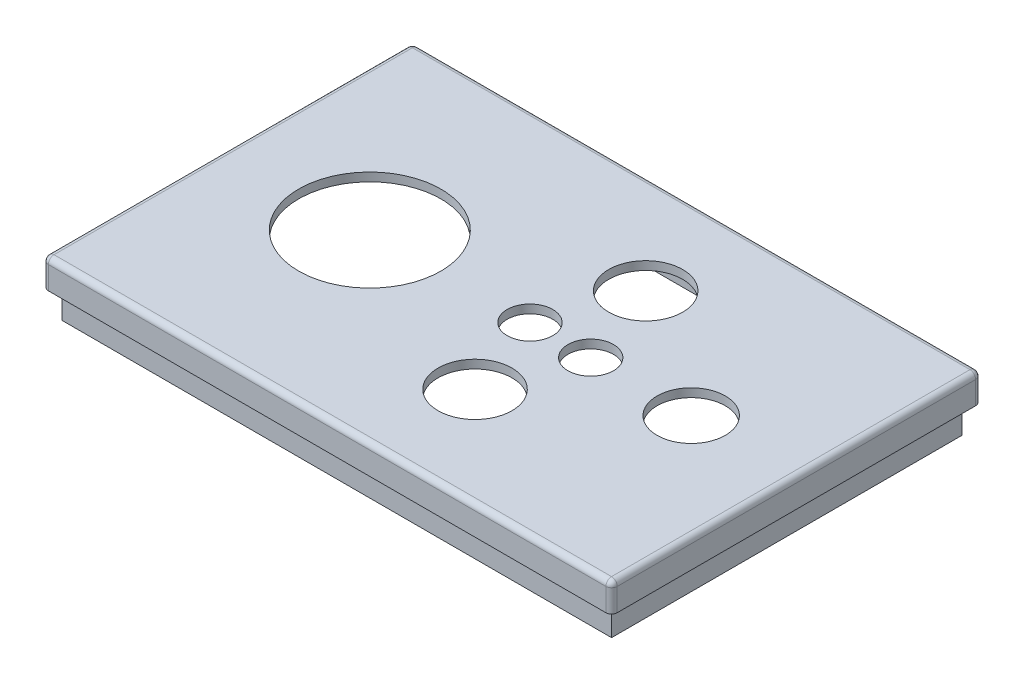
ISO-10303-21;
HEADER;
FILE_DESCRIPTION(('STEP AP214'),'2;1');
FILE_NAME('part.step','',(''),(''),'','','');
FILE_SCHEMA(('AUTOMOTIVE_DESIGN { 1 0 10303 214 1 1 1 1 }'));
ENDSEC;
DATA;
#1=APPLICATION_CONTEXT('core data for automotive mechanical design processes');
#2=APPLICATION_PROTOCOL_DEFINITION('international standard','automotive_design',2000,#1);
#3=PRODUCT_CONTEXT('',#1,'mechanical');
#4=PRODUCT('Part','Part','',(#3));
#5=PRODUCT_RELATED_PRODUCT_CATEGORY('part','',(#4));
#6=PRODUCT_DEFINITION_FORMATION('','',#4);
#7=PRODUCT_DEFINITION_CONTEXT('part definition',#1,'design');
#8=PRODUCT_DEFINITION('design','',#6,#7);
#9=PRODUCT_DEFINITION_SHAPE('','',#8);
#10=(LENGTH_UNIT() NAMED_UNIT(*) SI_UNIT(.MILLI.,.METRE.));
#11=(NAMED_UNIT(*) PLANE_ANGLE_UNIT() SI_UNIT($,.RADIAN.));
#12=(NAMED_UNIT(*) SI_UNIT($,.STERADIAN.) SOLID_ANGLE_UNIT());
#13=UNCERTAINTY_MEASURE_WITH_UNIT(LENGTH_MEASURE(1.E-05),#10,'distance_accuracy_value','');
#14=(GEOMETRIC_REPRESENTATION_CONTEXT(3) GLOBAL_UNCERTAINTY_ASSIGNED_CONTEXT((#13)) GLOBAL_UNIT_ASSIGNED_CONTEXT((#10,
#11,#12)) REPRESENTATION_CONTEXT('',''));
#15=CARTESIAN_POINT('',(0.,0.,0.));
#16=DIRECTION('',(0.,0.,1.));
#17=DIRECTION('',(1.,0.,0.));
#18=AXIS2_PLACEMENT_3D('',#15,#16,#17);
#19=CARTESIAN_POINT('',(0.,75.,0.));
#20=DIRECTION('',(0.,1.,0.));
#21=DIRECTION('',(0.,0.,1.));
#22=AXIS2_PLACEMENT_3D('',#19,#20,#21);
#23=PLANE('',#22);
#24=DIRECTION('',(-1.,0.,0.));
#25=VECTOR('',#24,1.);
#26=CARTESIAN_POINT('',(-47.0604562737643,75.,-41.1555133079848));
#27=LINE('',#26,#25);
#28=CARTESIAN_POINT('',(49.5395437262358,75.,-41.1555133079848));
#29=VERTEX_POINT('',#28);
#30=CARTESIAN_POINT('',(-47.0604562737643,75.,-41.1555133079848));
#31=VERTEX_POINT('',#30);
#32=EDGE_CURVE('E193',#29,#31,#27,.T.);
#33=ORIENTED_EDGE('',*,*,#32,.T.);
#34=DIRECTION('',(0.,0.,1.));
#35=VECTOR('',#34,1.);
#36=CARTESIAN_POINT('',(-47.0604562737643,75.,-41.1555133079848));
#37=LINE('',#36,#35);
#38=CARTESIAN_POINT('',(-47.0604562737643,75.,20.4444866920152));
#39=VERTEX_POINT('',#38);
#40=EDGE_CURVE('E48',#31,#39,#37,.T.);
#41=ORIENTED_EDGE('',*,*,#40,.T.);
#42=DIRECTION('',(1.,0.,0.));
#43=VECTOR('',#42,1.);
#44=CARTESIAN_POINT('',(-47.0604562737643,75.,20.4444866920152));
#45=LINE('',#44,#43);
#46=CARTESIAN_POINT('',(49.5395437262358,75.,20.4444866920152));
#47=VERTEX_POINT('',#46);
#48=EDGE_CURVE('E204',#39,#47,#45,.T.);
#49=ORIENTED_EDGE('',*,*,#48,.T.);
#50=DIRECTION('',(0.,0.,-1.));
#51=VECTOR('',#50,1.);
#52=CARTESIAN_POINT('',(49.5395437262358,75.,-41.1555133079848));
#53=LINE('',#52,#51);
#54=EDGE_CURVE('E207',#47,#29,#53,.T.);
#55=ORIENTED_EDGE('',*,*,#54,.T.);
#56=EDGE_LOOP('',(#33,#41,#49,#55));
#57=FACE_BOUND('',#56,.T.);
#58=CARTESIAN_POINT('',(-47.7604562737643,75.,21.1444866920152));
#59=DIRECTION('',(0.,1.,0.));
#60=DIRECTION('',(0.,0.,1.));
#61=AXIS2_PLACEMENT_3D('',#58,#59,#60);
#62=CIRCLE('',#61,1.);
#63=CARTESIAN_POINT('',(-47.7604562737643,75.,22.1444866920152));
#64=VERTEX_POINT('',#63);
#65=CARTESIAN_POINT('',(-48.7604562737643,75.,21.1444866920152));
#66=VERTEX_POINT('',#65);
#67=EDGE_CURVE('E35',#64,#66,#62,.F.);
#68=ORIENTED_EDGE('',*,*,#67,.T.);
#69=DIRECTION('',(0.,0.,1.));
#70=VECTOR('',#69,1.);
#71=CARTESIAN_POINT('',(-48.7604562737643,75.,-42.8555133079848));
#72=LINE('',#71,#70);
#73=CARTESIAN_POINT('',(-48.7604562737643,75.,-41.8555133079848));
#74=VERTEX_POINT('',#73);
#75=EDGE_CURVE('E342',#74,#66,#72,.T.);
#76=ORIENTED_EDGE('',*,*,#75,.F.);
#77=CARTESIAN_POINT('',(-47.7604562737643,75.,-41.8555133079848));
#78=DIRECTION('',(0.,1.,0.));
#79=DIRECTION('',(0.,0.,1.));
#80=AXIS2_PLACEMENT_3D('',#77,#78,#79);
#81=CIRCLE('',#80,1.);
#82=CARTESIAN_POINT('',(-47.7604562737643,75.,-42.8555133079848));
#83=VERTEX_POINT('',#82);
#84=EDGE_CURVE('E345',#74,#83,#81,.F.);
#85=ORIENTED_EDGE('',*,*,#84,.T.);
#86=DIRECTION('',(-1.,0.,0.));
#87=VECTOR('',#86,1.);
#88=CARTESIAN_POINT('',(-48.7604562737643,75.,-42.8555133079848));
#89=LINE('',#88,#87);
#90=CARTESIAN_POINT('',(50.2395437262357,75.,-42.8555133079848));
#91=VERTEX_POINT('',#90);
#92=EDGE_CURVE('E306',#91,#83,#89,.T.);
#93=ORIENTED_EDGE('',*,*,#92,.F.);
#94=CARTESIAN_POINT('',(50.2395437262357,75.,-41.8555133079848));
#95=DIRECTION('',(0.,1.,0.));
#96=DIRECTION('',(0.,0.,1.));
#97=AXIS2_PLACEMENT_3D('',#94,#95,#96);
#98=CIRCLE('',#97,1.);
#99=CARTESIAN_POINT('',(51.2395437262357,75.,-41.8555133079848));
#100=VERTEX_POINT('',#99);
#101=EDGE_CURVE('E11',#91,#100,#98,.F.);
#102=ORIENTED_EDGE('',*,*,#101,.T.);
#103=DIRECTION('',(0.,0.,-1.));
#104=VECTOR('',#103,1.);
#105=CARTESIAN_POINT('',(51.2395437262357,75.,-42.8555133079848));
#106=LINE('',#105,#104);
#107=CARTESIAN_POINT('',(51.2395437262358,75.,21.1444866920152));
#108=VERTEX_POINT('',#107);
#109=EDGE_CURVE('E340',#108,#100,#106,.T.);
#110=ORIENTED_EDGE('',*,*,#109,.F.);
#111=CARTESIAN_POINT('',(50.2395437262358,75.,21.1444866920152));
#112=DIRECTION('',(0.,1.,0.));
#113=DIRECTION('',(0.,0.,1.));
#114=AXIS2_PLACEMENT_3D('',#111,#112,#113);
#115=CIRCLE('',#114,1.);
#116=CARTESIAN_POINT('',(50.2395437262358,75.,22.1444866920152));
#117=VERTEX_POINT('',#116);
#118=EDGE_CURVE('E40',#108,#117,#115,.F.);
#119=ORIENTED_EDGE('',*,*,#118,.T.);
#120=DIRECTION('',(1.,0.,0.));
#121=VECTOR('',#120,1.);
#122=CARTESIAN_POINT('',(-48.7604562737643,75.,22.1444866920152));
#123=LINE('',#122,#121);
#124=EDGE_CURVE('E348',#64,#117,#123,.T.);
#125=ORIENTED_EDGE('',*,*,#124,.F.);
#126=EDGE_LOOP('',(#68,#76,#85,#93,#102,#110,#119,#125));
#127=FACE_BOUND('',#126,.T.);
#128=ADVANCED_FACE('F32',(#57,#127),#23,.F.);
#129=CARTESIAN_POINT('',(-48.7604562737643,80.,22.1444866920152));
#130=DIRECTION('',(0.,0.,-1.));
#131=DIRECTION('',(-1.,0.,0.));
#132=AXIS2_PLACEMENT_3D('',#129,#130,#131);
#133=PLANE('',#132);
#134=DIRECTION('',(0.,-1.,0.));
#135=VECTOR('',#134,1.);
#136=CARTESIAN_POINT('',(-47.7604562737643,80.,22.1444866920152));
#137=LINE('',#136,#135);
#138=CARTESIAN_POINT('',(-47.7604562737643,79.,22.1444866920152));
#139=VERTEX_POINT('',#138);
#140=EDGE_CURVE('E299',#139,#64,#137,.T.);
#141=ORIENTED_EDGE('',*,*,#140,.T.);
#142=ORIENTED_EDGE('',*,*,#124,.T.);
#143=DIRECTION('',(0.,-1.,0.));
#144=VECTOR('',#143,1.);
#145=CARTESIAN_POINT('',(50.2395437262358,80.,22.1444866920152));
#146=LINE('',#145,#144);
#147=CARTESIAN_POINT('',(50.2395437262358,79.,22.1444866920152));
#148=VERTEX_POINT('',#147);
#149=EDGE_CURVE('E304',#117,#148,#146,.F.);
#150=ORIENTED_EDGE('',*,*,#149,.T.);
#151=DIRECTION('',(1.,0.,0.));
#152=VECTOR('',#151,1.);
#153=CARTESIAN_POINT('',(-48.7604562737643,79.,22.1444866920152));
#154=LINE('',#153,#152);
#155=EDGE_CURVE('E302',#148,#139,#154,.F.);
#156=ORIENTED_EDGE('',*,*,#155,.T.);
#157=EDGE_LOOP('',(#141,#142,#150,#156));
#158=FACE_BOUND('',#157,.T.);
#159=ADVANCED_FACE('F402',(#158),#133,.F.);
#160=CARTESIAN_POINT('',(0.,80.,0.));
#161=DIRECTION('',(0.,1.,0.));
#162=DIRECTION('',(0.,0.,1.));
#163=AXIS2_PLACEMENT_3D('',#160,#161,#162);
#164=PLANE('',#163);
#165=CARTESIAN_POINT('',(9.73954372623576,80.,4.64448669201521));
#166=DIRECTION('',(0.,1.,0.));
#167=DIRECTION('',(0.,0.,1.));
#168=AXIS2_PLACEMENT_3D('',#165,#166,#167);
#169=CIRCLE('',#168,6.5);
#170=CARTESIAN_POINT('',(9.73954372623576,80.,11.1444866920152));
#171=VERTEX_POINT('',#170);
#172=EDGE_CURVE('E224',#171,#171,#169,.T.);
#173=ORIENTED_EDGE('',*,*,#172,.F.);
#174=EDGE_LOOP('',(#173));
#175=FACE_BOUND('',#174,.T.);
#176=CARTESIAN_POINT('',(9.73954372623576,80.,-25.3555133079848));
#177=DIRECTION('',(0.,1.,0.));
#178=DIRECTION('',(0.,0.,1.));
#179=AXIS2_PLACEMENT_3D('',#176,#177,#178);
#180=CIRCLE('',#179,6.5);
#181=CARTESIAN_POINT('',(9.73954372623576,80.,-18.8555133079848));
#182=VERTEX_POINT('',#181);
#183=EDGE_CURVE('E214',#182,#182,#180,.T.);
#184=ORIENTED_EDGE('',*,*,#183,.F.);
#185=EDGE_LOOP('',(#184));
#186=FACE_BOUND('',#185,.T.);
#187=CARTESIAN_POINT('',(4.39954372623574,80.,-10.3555133079848));
#188=DIRECTION('',(0.,1.,0.));
#189=DIRECTION('',(0.,0.,1.));
#190=AXIS2_PLACEMENT_3D('',#187,#188,#189);
#191=CIRCLE('',#190,4.);
#192=CARTESIAN_POINT('',(4.39954372623574,80.,-6.35551330798479));
#193=VERTEX_POINT('',#192);
#194=EDGE_CURVE('E236',#193,#193,#191,.T.);
#195=ORIENTED_EDGE('',*,*,#194,.F.);
#196=EDGE_LOOP('',(#195));
#197=FACE_BOUND('',#196,.T.);
#198=CARTESIAN_POINT('',(15.0795437262358,80.,-10.3555133079848));
#199=DIRECTION('',(0.,1.,0.));
#200=DIRECTION('',(0.,0.,1.));
#201=AXIS2_PLACEMENT_3D('',#198,#199,#200);
#202=CIRCLE('',#201,4.);
#203=CARTESIAN_POINT('',(15.0795437262358,80.,-6.35551330798479));
#204=VERTEX_POINT('',#203);
#205=EDGE_CURVE('E223',#204,#204,#202,.T.);
#206=ORIENTED_EDGE('',*,*,#205,.F.);
#207=EDGE_LOOP('',(#206));
#208=FACE_BOUND('',#207,.T.);
#209=CARTESIAN_POINT('',(-23.7604562737643,80.,-10.3555133079848));
#210=DIRECTION('',(0.,1.,0.));
#211=DIRECTION('',(0.,0.,1.));
#212=AXIS2_PLACEMENT_3D('',#209,#210,#211);
#213=CIRCLE('',#212,12.5);
#214=CARTESIAN_POINT('',(-23.7604562737643,80.,2.14448669201522));
#215=VERTEX_POINT('',#214);
#216=EDGE_CURVE('E248',#215,#215,#213,.T.);
#217=ORIENTED_EDGE('',*,*,#216,.F.);
#218=EDGE_LOOP('',(#217));
#219=FACE_BOUND('',#218,.T.);
#220=CARTESIAN_POINT('',(32.7395437262358,80.,-10.3555133079848));
#221=DIRECTION('',(0.,1.,0.));
#222=DIRECTION('',(0.,0.,1.));
#223=AXIS2_PLACEMENT_3D('',#220,#221,#222);
#224=CIRCLE('',#223,5.99999999999999);
#225=CARTESIAN_POINT('',(32.7395437262358,80.,-4.35551330798479));
#226=VERTEX_POINT('',#225);
#227=EDGE_CURVE('E235',#226,#226,#224,.T.);
#228=ORIENTED_EDGE('',*,*,#227,.F.);
#229=EDGE_LOOP('',(#228));
#230=FACE_BOUND('',#229,.T.);
#231=DIRECTION('',(1.,0.,0.));
#232=VECTOR('',#231,1.);
#233=CARTESIAN_POINT('',(51.2395437262358,80.,21.1444866920152));
#234=LINE('',#233,#232);
#235=CARTESIAN_POINT('',(-47.7604562737643,80.,21.1444866920152));
#236=VERTEX_POINT('',#235);
#237=CARTESIAN_POINT('',(50.2395437262358,80.,21.1444866920152));
#238=VERTEX_POINT('',#237);
#239=EDGE_CURVE('E264',#236,#238,#234,.T.);
#240=ORIENTED_EDGE('',*,*,#239,.T.);
#241=DIRECTION('',(0.,0.,-1.));
#242=VECTOR('',#241,1.);
#243=CARTESIAN_POINT('',(50.2395437262357,80.,-42.8555133079848));
#244=LINE('',#243,#242);
#245=CARTESIAN_POINT('',(50.2395437262357,80.,-41.8555133079848));
#246=VERTEX_POINT('',#245);
#247=EDGE_CURVE('E274',#238,#246,#244,.T.);
#248=ORIENTED_EDGE('',*,*,#247,.T.);
#249=DIRECTION('',(-1.,0.,0.));
#250=VECTOR('',#249,1.);
#251=CARTESIAN_POINT('',(-48.7604562737643,80.,-41.8555133079848));
#252=LINE('',#251,#250);
#253=CARTESIAN_POINT('',(-47.7604562737643,80.,-41.8555133079848));
#254=VERTEX_POINT('',#253);
#255=EDGE_CURVE('E272',#246,#254,#252,.T.);
#256=ORIENTED_EDGE('',*,*,#255,.T.);
#257=DIRECTION('',(0.,0.,1.));
#258=VECTOR('',#257,1.);
#259=CARTESIAN_POINT('',(-47.7604562737643,80.,22.1444866920152));
#260=LINE('',#259,#258);
#261=EDGE_CURVE('E270',#254,#236,#260,.T.);
#262=ORIENTED_EDGE('',*,*,#261,.T.);
#263=EDGE_LOOP('',(#240,#248,#256,#262));
#264=FACE_BOUND('',#263,.T.);
#265=ADVANCED_FACE('F423',(#175,#186,#197,#208,#219,#230,#264),#164,.T.);
#266=CARTESIAN_POINT('',(-48.7604562737643,80.,-42.8555133079848));
#267=DIRECTION('',(1.,0.,0.));
#268=DIRECTION('',(0.,0.,-1.));
#269=AXIS2_PLACEMENT_3D('',#266,#267,#268);
#270=PLANE('',#269);
#271=DIRECTION('',(0.,-1.,0.));
#272=VECTOR('',#271,1.);
#273=CARTESIAN_POINT('',(-48.7604562737643,80.,-41.8555133079848));
#274=LINE('',#273,#272);
#275=CARTESIAN_POINT('',(-48.7604562737643,79.,-41.8555133079848));
#276=VERTEX_POINT('',#275);
#277=EDGE_CURVE('E292',#276,#74,#274,.T.);
#278=ORIENTED_EDGE('',*,*,#277,.T.);
#279=ORIENTED_EDGE('',*,*,#75,.T.);
#280=DIRECTION('',(0.,-1.,0.));
#281=VECTOR('',#280,1.);
#282=CARTESIAN_POINT('',(-48.7604562737643,80.,21.1444866920152));
#283=LINE('',#282,#281);
#284=CARTESIAN_POINT('',(-48.7604562737643,79.,21.1444866920152));
#285=VERTEX_POINT('',#284);
#286=EDGE_CURVE('E297',#66,#285,#283,.F.);
#287=ORIENTED_EDGE('',*,*,#286,.T.);
#288=DIRECTION('',(0.,0.,1.));
#289=VECTOR('',#288,1.);
#290=CARTESIAN_POINT('',(-48.7604562737643,79.,-42.8555133079848));
#291=LINE('',#290,#289);
#292=EDGE_CURVE('E295',#285,#276,#291,.F.);
#293=ORIENTED_EDGE('',*,*,#292,.T.);
#294=EDGE_LOOP('',(#278,#279,#287,#293));
#295=FACE_BOUND('',#294,.T.);
#296=ADVANCED_FACE('F361',(#295),#270,.F.);
#297=CARTESIAN_POINT('',(51.2395437262357,80.,-42.8555133079848));
#298=DIRECTION('',(-1.,0.,0.));
#299=DIRECTION('',(0.,0.,1.));
#300=AXIS2_PLACEMENT_3D('',#297,#298,#299);
#301=PLANE('',#300);
#302=DIRECTION('',(0.,-1.,0.));
#303=VECTOR('',#302,1.);
#304=CARTESIAN_POINT('',(51.2395437262358,80.,21.1444866920152));
#305=LINE('',#304,#303);
#306=CARTESIAN_POINT('',(51.2395437262358,79.,21.1444866920152));
#307=VERTEX_POINT('',#306);
#308=EDGE_CURVE('E282',#307,#108,#305,.T.);
#309=ORIENTED_EDGE('',*,*,#308,.T.);
#310=ORIENTED_EDGE('',*,*,#109,.T.);
#311=DIRECTION('',(0.,-1.,0.));
#312=VECTOR('',#311,1.);
#313=CARTESIAN_POINT('',(51.2395437262357,80.,-41.8555133079848));
#314=LINE('',#313,#312);
#315=CARTESIAN_POINT('',(51.2395437262357,79.,-41.8555133079848));
#316=VERTEX_POINT('',#315);
#317=EDGE_CURVE('E277',#100,#316,#314,.F.);
#318=ORIENTED_EDGE('',*,*,#317,.T.);
#319=DIRECTION('',(0.,0.,-1.));
#320=VECTOR('',#319,1.);
#321=CARTESIAN_POINT('',(51.2395437262358,79.,22.1444866920152));
#322=LINE('',#321,#320);
#323=EDGE_CURVE('E279',#316,#307,#322,.F.);
#324=ORIENTED_EDGE('',*,*,#323,.T.);
#325=EDGE_LOOP('',(#309,#310,#318,#324));
#326=FACE_BOUND('',#325,.T.);
#327=ADVANCED_FACE('F395',(#326),#301,.F.);
#328=CARTESIAN_POINT('',(-48.7604562737643,80.,-42.8555133079848));
#329=DIRECTION('',(0.,0.,1.));
#330=DIRECTION('',(1.,0.,0.));
#331=AXIS2_PLACEMENT_3D('',#328,#329,#330);
#332=PLANE('',#331);
#333=DIRECTION('',(0.,-1.,0.));
#334=VECTOR('',#333,1.);
#335=CARTESIAN_POINT('',(50.2395437262357,80.,-42.8555133079848));
#336=LINE('',#335,#334);
#337=CARTESIAN_POINT('',(50.2395437262357,79.,-42.8555133079848));
#338=VERTEX_POINT('',#337);
#339=EDGE_CURVE('E285',#338,#91,#336,.T.);
#340=ORIENTED_EDGE('',*,*,#339,.T.);
#341=ORIENTED_EDGE('',*,*,#92,.T.);
#342=DIRECTION('',(0.,-1.,0.));
#343=VECTOR('',#342,1.);
#344=CARTESIAN_POINT('',(-47.7604562737643,80.,-42.8555133079848));
#345=LINE('',#344,#343);
#346=CARTESIAN_POINT('',(-47.7604562737643,79.,-42.8555133079848));
#347=VERTEX_POINT('',#346);
#348=EDGE_CURVE('E290',#83,#347,#345,.F.);
#349=ORIENTED_EDGE('',*,*,#348,.T.);
#350=DIRECTION('',(-1.,0.,0.));
#351=VECTOR('',#350,1.);
#352=CARTESIAN_POINT('',(51.2395437262357,79.,-42.8555133079848));
#353=LINE('',#352,#351);
#354=EDGE_CURVE('E288',#347,#338,#353,.F.);
#355=ORIENTED_EDGE('',*,*,#354,.T.);
#356=EDGE_LOOP('',(#340,#341,#349,#355));
#357=FACE_BOUND('',#356,.T.);
#358=ADVANCED_FACE('F379',(#357),#332,.F.);
#359=CARTESIAN_POINT('',(0.,78.5,0.));
#360=DIRECTION('',(0.,1.,0.));
#361=DIRECTION('',(0.,0.,1.));
#362=AXIS2_PLACEMENT_3D('',#359,#360,#361);
#363=PLANE('',#362);
#364=CARTESIAN_POINT('',(9.73954372623576,78.5,4.64448669201521));
#365=DIRECTION('',(0.,1.,0.));
#366=DIRECTION('',(0.,0.,1.));
#367=AXIS2_PLACEMENT_3D('',#364,#365,#366);
#368=CIRCLE('',#367,6.5);
#369=CARTESIAN_POINT('',(9.73954372623576,78.5,11.1444866920152));
#370=VERTEX_POINT('',#369);
#371=EDGE_CURVE('E220',#370,#370,#368,.T.);
#372=ORIENTED_EDGE('',*,*,#371,.T.);
#373=EDGE_LOOP('',(#372));
#374=FACE_BOUND('',#373,.T.);
#375=CARTESIAN_POINT('',(9.73954372623576,78.5,-25.3555133079848));
#376=DIRECTION('',(0.,1.,0.));
#377=DIRECTION('',(0.,0.,1.));
#378=AXIS2_PLACEMENT_3D('',#375,#376,#377);
#379=CIRCLE('',#378,6.5);
#380=CARTESIAN_POINT('',(9.73954372623576,78.5,-18.8555133079848));
#381=VERTEX_POINT('',#380);
#382=EDGE_CURVE('E227',#381,#381,#379,.T.);
#383=ORIENTED_EDGE('',*,*,#382,.T.);
#384=EDGE_LOOP('',(#383));
#385=FACE_BOUND('',#384,.T.);
#386=CARTESIAN_POINT('',(4.39954372623574,78.5,-10.3555133079848));
#387=DIRECTION('',(0.,1.,0.));
#388=DIRECTION('',(0.,0.,1.));
#389=AXIS2_PLACEMENT_3D('',#386,#387,#388);
#390=CIRCLE('',#389,4.);
#391=CARTESIAN_POINT('',(4.39954372623574,78.5,-6.35551330798479));
#392=VERTEX_POINT('',#391);
#393=EDGE_CURVE('E232',#392,#392,#390,.T.);
#394=ORIENTED_EDGE('',*,*,#393,.T.);
#395=EDGE_LOOP('',(#394));
#396=FACE_BOUND('',#395,.T.);
#397=CARTESIAN_POINT('',(15.0795437262358,78.5,-10.3555133079848));
#398=DIRECTION('',(0.,1.,0.));
#399=DIRECTION('',(0.,0.,1.));
#400=AXIS2_PLACEMENT_3D('',#397,#398,#399);
#401=CIRCLE('',#400,4.);
#402=CARTESIAN_POINT('',(15.0795437262358,78.5,-6.35551330798479));
#403=VERTEX_POINT('',#402);
#404=EDGE_CURVE('E239',#403,#403,#401,.T.);
#405=ORIENTED_EDGE('',*,*,#404,.T.);
#406=EDGE_LOOP('',(#405));
#407=FACE_BOUND('',#406,.T.);
#408=CARTESIAN_POINT('',(-23.7604562737643,78.5,-10.3555133079848));
#409=DIRECTION('',(0.,1.,0.));
#410=DIRECTION('',(0.,0.,1.));
#411=AXIS2_PLACEMENT_3D('',#408,#409,#410);
#412=CIRCLE('',#411,12.5);
#413=CARTESIAN_POINT('',(-23.7604562737643,78.5,2.14448669201522));
#414=VERTEX_POINT('',#413);
#415=EDGE_CURVE('E244',#414,#414,#412,.T.);
#416=ORIENTED_EDGE('',*,*,#415,.T.);
#417=EDGE_LOOP('',(#416));
#418=FACE_BOUND('',#417,.T.);
#419=CARTESIAN_POINT('',(32.7395437262358,78.5,-10.3555133079848));
#420=DIRECTION('',(0.,1.,0.));
#421=DIRECTION('',(0.,0.,1.));
#422=AXIS2_PLACEMENT_3D('',#419,#420,#421);
#423=CIRCLE('',#422,5.99999999999999);
#424=CARTESIAN_POINT('',(32.7395437262358,78.5,-4.35551330798479));
#425=VERTEX_POINT('',#424);
#426=EDGE_CURVE('E251',#425,#425,#423,.T.);
#427=ORIENTED_EDGE('',*,*,#426,.T.);
#428=EDGE_LOOP('',(#427));
#429=FACE_BOUND('',#428,.T.);
#430=DIRECTION('',(-1.,0.,0.));
#431=VECTOR('',#430,1.);
#432=CARTESIAN_POINT('',(47.5395437262358,78.5,18.4444866920152));
#433=LINE('',#432,#431);
#434=CARTESIAN_POINT('',(47.5395437262358,78.5,18.4444866920152));
#435=VERTEX_POINT('',#434);
#436=CARTESIAN_POINT('',(-45.0604562737642,78.5,18.4444866920152));
#437=VERTEX_POINT('',#436);
#438=EDGE_CURVE('E262',#435,#437,#433,.T.);
#439=ORIENTED_EDGE('',*,*,#438,.T.);
#440=DIRECTION('',(0.,0.,-1.));
#441=VECTOR('',#440,1.);
#442=CARTESIAN_POINT('',(-45.0604562737642,78.5,-39.1555133079848));
#443=LINE('',#442,#441);
#444=CARTESIAN_POINT('',(-45.0604562737642,78.5,-39.1555133079848));
#445=VERTEX_POINT('',#444);
#446=EDGE_CURVE('E166',#437,#445,#443,.T.);
#447=ORIENTED_EDGE('',*,*,#446,.T.);
#448=DIRECTION('',(1.,0.,0.));
#449=VECTOR('',#448,1.);
#450=CARTESIAN_POINT('',(47.5395437262358,78.5,-39.1555133079848));
#451=LINE('',#450,#449);
#452=CARTESIAN_POINT('',(47.5395437262358,78.5,-39.1555133079848));
#453=VERTEX_POINT('',#452);
#454=EDGE_CURVE('E266',#445,#453,#451,.T.);
#455=ORIENTED_EDGE('',*,*,#454,.T.);
#456=DIRECTION('',(0.,0.,1.));
#457=VECTOR('',#456,1.);
#458=CARTESIAN_POINT('',(47.5395437262358,78.5,-39.1555133079848));
#459=LINE('',#458,#457);
#460=EDGE_CURVE('E260',#453,#435,#459,.T.);
#461=ORIENTED_EDGE('',*,*,#460,.T.);
#462=EDGE_LOOP('',(#439,#447,#455,#461));
#463=FACE_BOUND('',#462,.T.);
#464=ADVANCED_FACE('F425',(#374,#385,#396,#407,#418,#429,#463),#363,.F.);
#465=CARTESIAN_POINT('',(47.5395437262358,80.002,-39.1555133079848));
#466=DIRECTION('',(1.,0.,0.));
#467=DIRECTION('',(0.,0.,-1.));
#468=AXIS2_PLACEMENT_3D('',#465,#466,#467);
#469=PLANE('',#468);
#470=DIRECTION('',(0.,-1.,0.));
#471=VECTOR('',#470,1.);
#472=CARTESIAN_POINT('',(47.5395437262358,80.002,-39.1555133079848));
#473=LINE('',#472,#471);
#474=CARTESIAN_POINT('',(47.5395437262358,70.,-39.1555133079848));
#475=VERTEX_POINT('',#474);
#476=EDGE_CURVE('E258',#453,#475,#473,.T.);
#477=ORIENTED_EDGE('',*,*,#476,.T.);
#478=DIRECTION('',(0.,0.,-1.));
#479=VECTOR('',#478,1.);
#480=CARTESIAN_POINT('',(47.5395437262358,70.,-41.1555133079848));
#481=LINE('',#480,#479);
#482=CARTESIAN_POINT('',(47.5395437262358,70.,18.4444866920152));
#483=VERTEX_POINT('',#482);
#484=EDGE_CURVE('E179',#483,#475,#481,.T.);
#485=ORIENTED_EDGE('',*,*,#484,.F.);
#486=DIRECTION('',(0.,-1.,0.));
#487=VECTOR('',#486,1.);
#488=CARTESIAN_POINT('',(47.5395437262358,80.002,18.4444866920152));
#489=LINE('',#488,#487);
#490=EDGE_CURVE('E170',#435,#483,#489,.T.);
#491=ORIENTED_EDGE('',*,*,#490,.F.);
#492=ORIENTED_EDGE('',*,*,#460,.F.);
#493=EDGE_LOOP('',(#477,#485,#491,#492));
#494=FACE_BOUND('',#493,.T.);
#495=ADVANCED_FACE('F459',(#494),#469,.F.);
#496=CARTESIAN_POINT('',(47.5395437262358,80.002,-39.1555133079848));
#497=DIRECTION('',(0.,0.,-1.));
#498=DIRECTION('',(-1.,0.,0.));
#499=AXIS2_PLACEMENT_3D('',#496,#497,#498);
#500=PLANE('',#499);
#501=DIRECTION('',(0.,-1.,0.));
#502=VECTOR('',#501,1.);
#503=CARTESIAN_POINT('',(-45.0604562737642,80.002,-39.1555133079848));
#504=LINE('',#503,#502);
#505=CARTESIAN_POINT('',(-45.0604562737643,70.,-39.1555133079848));
#506=VERTEX_POINT('',#505);
#507=EDGE_CURVE('E169',#445,#506,#504,.T.);
#508=ORIENTED_EDGE('',*,*,#507,.T.);
#509=DIRECTION('',(-1.,0.,0.));
#510=VECTOR('',#509,1.);
#511=CARTESIAN_POINT('',(-47.0604562737643,70.,-39.1555133079848));
#512=LINE('',#511,#510);
#513=EDGE_CURVE('E184',#475,#506,#512,.T.);
#514=ORIENTED_EDGE('',*,*,#513,.F.);
#515=ORIENTED_EDGE('',*,*,#476,.F.);
#516=ORIENTED_EDGE('',*,*,#454,.F.);
#517=EDGE_LOOP('',(#508,#514,#515,#516));
#518=FACE_BOUND('',#517,.T.);
#519=ADVANCED_FACE('F462',(#518),#500,.F.);
#520=CARTESIAN_POINT('',(-45.0604562737642,80.002,-39.1555133079848));
#521=DIRECTION('',(-1.,0.,0.));
#522=DIRECTION('',(0.,0.,1.));
#523=AXIS2_PLACEMENT_3D('',#520,#521,#522);
#524=PLANE('',#523);
#525=DIRECTION('',(0.,-1.,0.));
#526=VECTOR('',#525,1.);
#527=CARTESIAN_POINT('',(-45.0604562737642,80.002,18.4444866920152));
#528=LINE('',#527,#526);
#529=CARTESIAN_POINT('',(-45.0604562737643,70.,18.4444866920152));
#530=VERTEX_POINT('',#529);
#531=EDGE_CURVE('E159',#437,#530,#528,.T.);
#532=ORIENTED_EDGE('',*,*,#531,.T.);
#533=DIRECTION('',(0.,0.,1.));
#534=VECTOR('',#533,1.);
#535=CARTESIAN_POINT('',(-45.0604562737643,70.,-41.1555133079848));
#536=LINE('',#535,#534);
#537=EDGE_CURVE('E164',#506,#530,#536,.T.);
#538=ORIENTED_EDGE('',*,*,#537,.F.);
#539=ORIENTED_EDGE('',*,*,#507,.F.);
#540=ORIENTED_EDGE('',*,*,#446,.F.);
#541=EDGE_LOOP('',(#532,#538,#539,#540));
#542=FACE_BOUND('',#541,.T.);
#543=ADVANCED_FACE('F161',(#542),#524,.F.);
#544=CARTESIAN_POINT('',(47.5395437262358,80.002,18.4444866920152));
#545=DIRECTION('',(0.,0.,1.));
#546=DIRECTION('',(1.,0.,0.));
#547=AXIS2_PLACEMENT_3D('',#544,#545,#546);
#548=PLANE('',#547);
#549=ORIENTED_EDGE('',*,*,#490,.T.);
#550=DIRECTION('',(1.,0.,0.));
#551=VECTOR('',#550,1.);
#552=CARTESIAN_POINT('',(-47.0604562737643,70.,18.4444866920152));
#553=LINE('',#552,#551);
#554=EDGE_CURVE('E173',#530,#483,#553,.T.);
#555=ORIENTED_EDGE('',*,*,#554,.F.);
#556=ORIENTED_EDGE('',*,*,#531,.F.);
#557=ORIENTED_EDGE('',*,*,#438,.F.);
#558=EDGE_LOOP('',(#549,#555,#556,#557));
#559=FACE_BOUND('',#558,.T.);
#560=ADVANCED_FACE('F174',(#559),#548,.F.);
#561=CARTESIAN_POINT('',(-47.7604562737643,80.,21.1444866920152));
#562=DIRECTION('',(0.,-1.,0.));
#563=DIRECTION('',(0.,0.,-1.));
#564=AXIS2_PLACEMENT_3D('',#561,#562,#563);
#565=CYLINDRICAL_SURFACE('',#564,1.);
#566=ORIENTED_EDGE('',*,*,#67,.F.);
#567=ORIENTED_EDGE('',*,*,#140,.F.);
#568=CARTESIAN_POINT('',(-47.7604562737643,79.,21.1444866920152));
#569=DIRECTION('',(0.,1.,0.));
#570=DIRECTION('',(0.,0.,1.));
#571=AXIS2_PLACEMENT_3D('',#568,#569,#570);
#572=CIRCLE('',#571,1.);
#573=EDGE_CURVE('E256',#285,#139,#572,.T.);
#574=ORIENTED_EDGE('',*,*,#573,.F.);
#575=ORIENTED_EDGE('',*,*,#286,.F.);
#576=EDGE_LOOP('',(#566,#567,#574,#575));
#577=FACE_BOUND('',#576,.T.);
#578=ADVANCED_FACE('F358',(#577),#565,.T.);
#579=CARTESIAN_POINT('',(-47.7604562737643,79.,0.));
#580=DIRECTION('',(0.,0.,-1.));
#581=DIRECTION('',(-1.,0.,0.));
#582=AXIS2_PLACEMENT_3D('',#579,#580,#581);
#583=CYLINDRICAL_SURFACE('',#582,1.);
#584=CARTESIAN_POINT('',(-47.7604562737643,79.,-41.8555133079848));
#585=DIRECTION('',(0.,0.,-1.));
#586=DIRECTION('',(-1.,0.,0.));
#587=AXIS2_PLACEMENT_3D('',#584,#585,#586);
#588=CIRCLE('',#587,1.);
#589=EDGE_CURVE('E331',#276,#254,#588,.T.);
#590=ORIENTED_EDGE('',*,*,#589,.F.);
#591=ORIENTED_EDGE('',*,*,#292,.F.);
#592=CARTESIAN_POINT('',(-47.7604562737643,79.,21.1444866920152));
#593=DIRECTION('',(0.,0.,1.));
#594=DIRECTION('',(1.,0.,0.));
#595=AXIS2_PLACEMENT_3D('',#592,#593,#594);
#596=CIRCLE('',#595,1.);
#597=EDGE_CURVE('E334',#236,#285,#596,.T.);
#598=ORIENTED_EDGE('',*,*,#597,.F.);
#599=ORIENTED_EDGE('',*,*,#261,.F.);
#600=EDGE_LOOP('',(#590,#591,#598,#599));
#601=FACE_BOUND('',#600,.T.);
#602=ADVANCED_FACE('F366',(#601),#583,.T.);
#603=CARTESIAN_POINT('',(-47.7604562737643,80.,-41.8555133079848));
#604=DIRECTION('',(0.,-1.,0.));
#605=DIRECTION('',(0.,0.,-1.));
#606=AXIS2_PLACEMENT_3D('',#603,#604,#605);
#607=CYLINDRICAL_SURFACE('',#606,1.);
#608=ORIENTED_EDGE('',*,*,#84,.F.);
#609=ORIENTED_EDGE('',*,*,#277,.F.);
#610=CARTESIAN_POINT('',(-47.7604562737643,79.,-41.8555133079848));
#611=DIRECTION('',(0.,1.,0.));
#612=DIRECTION('',(0.,0.,1.));
#613=AXIS2_PLACEMENT_3D('',#610,#611,#612);
#614=CIRCLE('',#613,1.);
#615=EDGE_CURVE('E328',#347,#276,#614,.T.);
#616=ORIENTED_EDGE('',*,*,#615,.F.);
#617=ORIENTED_EDGE('',*,*,#348,.F.);
#618=EDGE_LOOP('',(#608,#609,#616,#617));
#619=FACE_BOUND('',#618,.T.);
#620=ADVANCED_FACE('F376',(#619),#607,.T.);
#621=CARTESIAN_POINT('',(-47.7604562737643,79.,21.1444866920152));
#622=DIRECTION('',(-1.,0.,0.));
#623=DIRECTION('',(0.,0.,1.));
#624=AXIS2_PLACEMENT_3D('',#621,#622,#623);
#625=SPHERICAL_SURFACE('',#624,1.);
#626=ORIENTED_EDGE('',*,*,#597,.T.);
#627=ORIENTED_EDGE('',*,*,#573,.T.);
#628=CARTESIAN_POINT('',(-47.7604562737643,79.,21.1444866920152));
#629=DIRECTION('',(-1.,0.,0.));
#630=DIRECTION('',(0.,0.,1.));
#631=AXIS2_PLACEMENT_3D('',#628,#629,#630);
#632=CIRCLE('',#631,1.);
#633=EDGE_CURVE('E325',#236,#139,#632,.F.);
#634=ORIENTED_EDGE('',*,*,#633,.F.);
#635=EDGE_LOOP('',(#626,#627,#634));
#636=FACE_BOUND('',#635,.T.);
#637=ADVANCED_FACE('F408',(#636),#625,.T.);
#638=CARTESIAN_POINT('',(-47.7604562737643,79.,-41.8555133079848));
#639=DIRECTION('',(-1.,0.,0.));
#640=DIRECTION('',(0.,0.,1.));
#641=AXIS2_PLACEMENT_3D('',#638,#639,#640);
#642=SPHERICAL_SURFACE('',#641,1.);
#643=ORIENTED_EDGE('',*,*,#615,.T.);
#644=ORIENTED_EDGE('',*,*,#589,.T.);
#645=CARTESIAN_POINT('',(-47.7604562737643,79.,-41.8555133079848));
#646=DIRECTION('',(-1.,0.,0.));
#647=DIRECTION('',(0.,0.,1.));
#648=AXIS2_PLACEMENT_3D('',#645,#646,#647);
#649=CIRCLE('',#648,1.);
#650=EDGE_CURVE('E322',#347,#254,#649,.F.);
#651=ORIENTED_EDGE('',*,*,#650,.F.);
#652=EDGE_LOOP('',(#643,#644,#651));
#653=FACE_BOUND('',#652,.T.);
#654=ADVANCED_FACE('F372',(#653),#642,.T.);
#655=CARTESIAN_POINT('',(50.2395437262358,80.,21.1444866920152));
#656=DIRECTION('',(0.,-1.,0.));
#657=DIRECTION('',(0.,0.,-1.));
#658=AXIS2_PLACEMENT_3D('',#655,#656,#657);
#659=CYLINDRICAL_SURFACE('',#658,1.);
#660=ORIENTED_EDGE('',*,*,#118,.F.);
#661=ORIENTED_EDGE('',*,*,#308,.F.);
#662=CARTESIAN_POINT('',(50.2395437262358,79.,21.1444866920152));
#663=DIRECTION('',(0.,1.,0.));
#664=DIRECTION('',(0.,0.,1.));
#665=AXIS2_PLACEMENT_3D('',#662,#663,#664);
#666=CIRCLE('',#665,1.);
#667=EDGE_CURVE('E319',#148,#307,#666,.T.);
#668=ORIENTED_EDGE('',*,*,#667,.F.);
#669=ORIENTED_EDGE('',*,*,#149,.F.);
#670=EDGE_LOOP('',(#660,#661,#668,#669));
#671=FACE_BOUND('',#670,.T.);
#672=ADVANCED_FACE('F400',(#671),#659,.T.);
#673=CARTESIAN_POINT('',(0.,79.,21.1444866920152));
#674=DIRECTION('',(-1.,0.,0.));
#675=DIRECTION('',(0.,0.,1.));
#676=AXIS2_PLACEMENT_3D('',#673,#674,#675);
#677=CYLINDRICAL_SURFACE('',#676,1.);
#678=ORIENTED_EDGE('',*,*,#633,.T.);
#679=ORIENTED_EDGE('',*,*,#155,.F.);
#680=CARTESIAN_POINT('',(50.2395437262358,79.,21.1444866920152));
#681=DIRECTION('',(1.,0.,0.));
#682=DIRECTION('',(0.,0.,-1.));
#683=AXIS2_PLACEMENT_3D('',#680,#681,#682);
#684=CIRCLE('',#683,1.);
#685=EDGE_CURVE('E316',#238,#148,#684,.T.);
#686=ORIENTED_EDGE('',*,*,#685,.F.);
#687=ORIENTED_EDGE('',*,*,#239,.F.);
#688=EDGE_LOOP('',(#678,#679,#686,#687));
#689=FACE_BOUND('',#688,.T.);
#690=ADVANCED_FACE('F405',(#689),#677,.T.);
#691=CARTESIAN_POINT('',(0.,79.,-41.8555133079848));
#692=DIRECTION('',(1.,0.,0.));
#693=DIRECTION('',(0.,0.,-1.));
#694=AXIS2_PLACEMENT_3D('',#691,#692,#693);
#695=CYLINDRICAL_SURFACE('',#694,1.);
#696=ORIENTED_EDGE('',*,*,#650,.T.);
#697=ORIENTED_EDGE('',*,*,#255,.F.);
#698=CARTESIAN_POINT('',(50.2395437262357,79.,-41.8555133079848));
#699=DIRECTION('',(1.,0.,0.));
#700=DIRECTION('',(0.,0.,-1.));
#701=AXIS2_PLACEMENT_3D('',#698,#699,#700);
#702=CIRCLE('',#701,1.);
#703=EDGE_CURVE('E313',#338,#246,#702,.T.);
#704=ORIENTED_EDGE('',*,*,#703,.F.);
#705=ORIENTED_EDGE('',*,*,#354,.F.);
#706=EDGE_LOOP('',(#696,#697,#704,#705));
#707=FACE_BOUND('',#706,.T.);
#708=ADVANCED_FACE('F386',(#707),#695,.T.);
#709=CARTESIAN_POINT('',(50.2395437262357,80.,-41.8555133079848));
#710=DIRECTION('',(0.,-1.,0.));
#711=DIRECTION('',(0.,0.,-1.));
#712=AXIS2_PLACEMENT_3D('',#709,#710,#711);
#713=CYLINDRICAL_SURFACE('',#712,1.);
#714=ORIENTED_EDGE('',*,*,#101,.F.);
#715=ORIENTED_EDGE('',*,*,#339,.F.);
#716=CARTESIAN_POINT('',(50.2395437262357,79.,-41.8555133079848));
#717=DIRECTION('',(0.,1.,0.));
#718=DIRECTION('',(0.,0.,1.));
#719=AXIS2_PLACEMENT_3D('',#716,#717,#718);
#720=CIRCLE('',#719,1.);
#721=EDGE_CURVE('E310',#316,#338,#720,.T.);
#722=ORIENTED_EDGE('',*,*,#721,.F.);
#723=ORIENTED_EDGE('',*,*,#317,.F.);
#724=EDGE_LOOP('',(#714,#715,#722,#723));
#725=FACE_BOUND('',#724,.T.);
#726=ADVANCED_FACE('F382',(#725),#713,.T.);
#727=CARTESIAN_POINT('',(50.2395437262358,79.,21.1444866920152));
#728=DIRECTION('',(0.,0.,1.));
#729=DIRECTION('',(1.,0.,0.));
#730=AXIS2_PLACEMENT_3D('',#727,#728,#729);
#731=SPHERICAL_SURFACE('',#730,1.);
#732=ORIENTED_EDGE('',*,*,#685,.T.);
#733=ORIENTED_EDGE('',*,*,#667,.T.);
#734=CARTESIAN_POINT('',(50.2395437262358,79.,21.1444866920152));
#735=DIRECTION('',(0.,0.,1.));
#736=DIRECTION('',(0.,-1.,0.));
#737=AXIS2_PLACEMENT_3D('',#734,#735,#736);
#738=CIRCLE('',#737,1.);
#739=EDGE_CURVE('E308',#238,#307,#738,.F.);
#740=ORIENTED_EDGE('',*,*,#739,.F.);
#741=EDGE_LOOP('',(#732,#733,#740));
#742=FACE_BOUND('',#741,.T.);
#743=ADVANCED_FACE('F487',(#742),#731,.T.);
#744=CARTESIAN_POINT('',(50.2395437262357,79.,-41.8555133079848));
#745=DIRECTION('',(0.,0.,-1.));
#746=DIRECTION('',(-1.,0.,0.));
#747=AXIS2_PLACEMENT_3D('',#744,#745,#746);
#748=SPHERICAL_SURFACE('',#747,1.);
#749=ORIENTED_EDGE('',*,*,#721,.T.);
#750=ORIENTED_EDGE('',*,*,#703,.T.);
#751=CARTESIAN_POINT('',(50.2395437262357,79.,-41.8555133079848));
#752=DIRECTION('',(0.,0.,-1.));
#753=DIRECTION('',(-1.,0.,0.));
#754=AXIS2_PLACEMENT_3D('',#751,#752,#753);
#755=CIRCLE('',#754,1.);
#756=EDGE_CURVE('E247',#316,#246,#755,.F.);
#757=ORIENTED_EDGE('',*,*,#756,.F.);
#758=EDGE_LOOP('',(#749,#750,#757));
#759=FACE_BOUND('',#758,.T.);
#760=ADVANCED_FACE('F389',(#759),#748,.T.);
#761=CARTESIAN_POINT('',(50.2395437262358,79.,0.));
#762=DIRECTION('',(0.,0.,1.));
#763=DIRECTION('',(1.,0.,0.));
#764=AXIS2_PLACEMENT_3D('',#761,#762,#763);
#765=CYLINDRICAL_SURFACE('',#764,1.);
#766=ORIENTED_EDGE('',*,*,#739,.T.);
#767=ORIENTED_EDGE('',*,*,#323,.F.);
#768=ORIENTED_EDGE('',*,*,#756,.T.);
#769=ORIENTED_EDGE('',*,*,#247,.F.);
#770=EDGE_LOOP('',(#766,#767,#768,#769));
#771=FACE_BOUND('',#770,.T.);
#772=ADVANCED_FACE('F392',(#771),#765,.T.);
#773=CARTESIAN_POINT('',(32.7395437262358,78.5,-10.3555133079848));
#774=DIRECTION('',(0.,1.,0.));
#775=DIRECTION('',(0.,0.,1.));
#776=AXIS2_PLACEMENT_3D('',#773,#774,#775);
#777=CYLINDRICAL_SURFACE('',#776,5.99999999999999);
#778=ORIENTED_EDGE('',*,*,#426,.F.);
#779=EDGE_LOOP('',(#778));
#780=FACE_BOUND('',#779,.T.);
#781=ORIENTED_EDGE('',*,*,#227,.T.);
#782=EDGE_LOOP('',(#781));
#783=FACE_BOUND('',#782,.T.);
#784=ADVANCED_FACE('F454',(#780,#783),#777,.F.);
#785=CARTESIAN_POINT('',(-23.7604562737643,78.5,-10.3555133079848));
#786=DIRECTION('',(0.,1.,0.));
#787=DIRECTION('',(0.,0.,1.));
#788=AXIS2_PLACEMENT_3D('',#785,#786,#787);
#789=CYLINDRICAL_SURFACE('',#788,12.5);
#790=ORIENTED_EDGE('',*,*,#415,.F.);
#791=EDGE_LOOP('',(#790));
#792=FACE_BOUND('',#791,.T.);
#793=ORIENTED_EDGE('',*,*,#216,.T.);
#794=EDGE_LOOP('',(#793));
#795=FACE_BOUND('',#794,.T.);
#796=ADVANCED_FACE('F450',(#792,#795),#789,.F.);
#797=CARTESIAN_POINT('',(15.0795437262358,78.5,-10.3555133079848));
#798=DIRECTION('',(0.,1.,0.));
#799=DIRECTION('',(0.,0.,1.));
#800=AXIS2_PLACEMENT_3D('',#797,#798,#799);
#801=CYLINDRICAL_SURFACE('',#800,4.);
#802=ORIENTED_EDGE('',*,*,#404,.F.);
#803=EDGE_LOOP('',(#802));
#804=FACE_BOUND('',#803,.T.);
#805=ORIENTED_EDGE('',*,*,#205,.T.);
#806=EDGE_LOOP('',(#805));
#807=FACE_BOUND('',#806,.T.);
#808=ADVANCED_FACE('F446',(#804,#807),#801,.F.);
#809=CARTESIAN_POINT('',(4.39954372623574,78.5,-10.3555133079848));
#810=DIRECTION('',(0.,1.,0.));
#811=DIRECTION('',(0.,0.,1.));
#812=AXIS2_PLACEMENT_3D('',#809,#810,#811);
#813=CYLINDRICAL_SURFACE('',#812,4.);
#814=ORIENTED_EDGE('',*,*,#393,.F.);
#815=EDGE_LOOP('',(#814));
#816=FACE_BOUND('',#815,.T.);
#817=ORIENTED_EDGE('',*,*,#194,.T.);
#818=EDGE_LOOP('',(#817));
#819=FACE_BOUND('',#818,.T.);
#820=ADVANCED_FACE('F437',(#816,#819),#813,.F.);
#821=CARTESIAN_POINT('',(9.73954372623576,78.5,-25.3555133079848));
#822=DIRECTION('',(0.,1.,0.));
#823=DIRECTION('',(0.,0.,1.));
#824=AXIS2_PLACEMENT_3D('',#821,#822,#823);
#825=CYLINDRICAL_SURFACE('',#824,6.5);
#826=ORIENTED_EDGE('',*,*,#382,.F.);
#827=EDGE_LOOP('',(#826));
#828=FACE_BOUND('',#827,.T.);
#829=ORIENTED_EDGE('',*,*,#183,.T.);
#830=EDGE_LOOP('',(#829));
#831=FACE_BOUND('',#830,.T.);
#832=ADVANCED_FACE('F428',(#828,#831),#825,.F.);
#833=CARTESIAN_POINT('',(9.73954372623576,78.5,4.64448669201521));
#834=DIRECTION('',(0.,1.,0.));
#835=DIRECTION('',(0.,0.,1.));
#836=AXIS2_PLACEMENT_3D('',#833,#834,#835);
#837=CYLINDRICAL_SURFACE('',#836,6.5);
#838=ORIENTED_EDGE('',*,*,#371,.F.);
#839=EDGE_LOOP('',(#838));
#840=FACE_BOUND('',#839,.T.);
#841=ORIENTED_EDGE('',*,*,#172,.T.);
#842=EDGE_LOOP('',(#841));
#843=FACE_BOUND('',#842,.T.);
#844=ADVANCED_FACE('F419',(#840,#843),#837,.F.);
#845=CARTESIAN_POINT('',(-47.0604562737643,70.,-41.1555133079848));
#846=DIRECTION('',(-1.,0.,0.));
#847=DIRECTION('',(0.,0.,1.));
#848=AXIS2_PLACEMENT_3D('',#845,#846,#847);
#849=PLANE('',#848);
#850=ORIENTED_EDGE('',*,*,#40,.F.);
#851=DIRECTION('',(0.,1.,0.));
#852=VECTOR('',#851,1.);
#853=CARTESIAN_POINT('',(-47.0604562737643,70.,-41.1555133079848));
#854=LINE('',#853,#852);
#855=CARTESIAN_POINT('',(-47.0604562737643,70.,-41.1555133079848));
#856=VERTEX_POINT('',#855);
#857=EDGE_CURVE('E212',#856,#31,#854,.T.);
#858=ORIENTED_EDGE('',*,*,#857,.F.);
#859=DIRECTION('',(0.,0.,1.));
#860=VECTOR('',#859,1.);
#861=CARTESIAN_POINT('',(-47.0604562737643,70.,-41.1555133079848));
#862=LINE('',#861,#860);
#863=CARTESIAN_POINT('',(-47.0604562737643,70.,20.4444866920152));
#864=VERTEX_POINT('',#863);
#865=EDGE_CURVE('E189',#856,#864,#862,.T.);
#866=ORIENTED_EDGE('',*,*,#865,.T.);
#867=DIRECTION('',(0.,1.,0.));
#868=VECTOR('',#867,1.);
#869=CARTESIAN_POINT('',(-47.0604562737643,70.,20.4444866920152));
#870=LINE('',#869,#868);
#871=EDGE_CURVE('E202',#864,#39,#870,.T.);
#872=ORIENTED_EDGE('',*,*,#871,.T.);
#873=EDGE_LOOP('',(#850,#858,#866,#872));
#874=FACE_BOUND('',#873,.T.);
#875=ADVANCED_FACE('F427',(#874),#849,.T.);
#876=CARTESIAN_POINT('',(-47.0604562737643,70.,-41.1555133079848));
#877=DIRECTION('',(0.,0.,-1.));
#878=DIRECTION('',(-1.,0.,0.));
#879=AXIS2_PLACEMENT_3D('',#876,#877,#878);
#880=PLANE('',#879);
#881=ORIENTED_EDGE('',*,*,#32,.F.);
#882=DIRECTION('',(0.,1.,0.));
#883=VECTOR('',#882,1.);
#884=CARTESIAN_POINT('',(49.5395437262358,70.,-41.1555133079848));
#885=LINE('',#884,#883);
#886=CARTESIAN_POINT('',(49.5395437262358,70.,-41.1555133079848));
#887=VERTEX_POINT('',#886);
#888=EDGE_CURVE('E215',#887,#29,#885,.T.);
#889=ORIENTED_EDGE('',*,*,#888,.F.);
#890=DIRECTION('',(-1.,0.,0.));
#891=VECTOR('',#890,1.);
#892=CARTESIAN_POINT('',(-47.0604562737643,70.,-41.1555133079848));
#893=LINE('',#892,#891);
#894=EDGE_CURVE('E199',#887,#856,#893,.T.);
#895=ORIENTED_EDGE('',*,*,#894,.T.);
#896=ORIENTED_EDGE('',*,*,#857,.T.);
#897=EDGE_LOOP('',(#881,#889,#895,#896));
#898=FACE_BOUND('',#897,.T.);
#899=ADVANCED_FACE('F435',(#898),#880,.T.);
#900=CARTESIAN_POINT('',(49.5395437262358,70.,-41.1555133079848));
#901=DIRECTION('',(1.,0.,0.));
#902=DIRECTION('',(0.,0.,-1.));
#903=AXIS2_PLACEMENT_3D('',#900,#901,#902);
#904=PLANE('',#903);
#905=ORIENTED_EDGE('',*,*,#54,.F.);
#906=DIRECTION('',(0.,1.,0.));
#907=VECTOR('',#906,1.);
#908=CARTESIAN_POINT('',(49.5395437262358,70.,20.4444866920152));
#909=LINE('',#908,#907);
#910=CARTESIAN_POINT('',(49.5395437262358,70.,20.4444866920152));
#911=VERTEX_POINT('',#910);
#912=EDGE_CURVE('E217',#911,#47,#909,.T.);
#913=ORIENTED_EDGE('',*,*,#912,.F.);
#914=DIRECTION('',(0.,0.,-1.));
#915=VECTOR('',#914,1.);
#916=CARTESIAN_POINT('',(49.5395437262358,70.,-41.1555133079848));
#917=LINE('',#916,#915);
#918=EDGE_CURVE('E196',#911,#887,#917,.T.);
#919=ORIENTED_EDGE('',*,*,#918,.T.);
#920=ORIENTED_EDGE('',*,*,#888,.T.);
#921=EDGE_LOOP('',(#905,#913,#919,#920));
#922=FACE_BOUND('',#921,.T.);
#923=ADVANCED_FACE('F578',(#922),#904,.T.);
#924=CARTESIAN_POINT('',(-47.0604562737643,70.,20.4444866920152));
#925=DIRECTION('',(0.,0.,1.));
#926=DIRECTION('',(1.,0.,0.));
#927=AXIS2_PLACEMENT_3D('',#924,#925,#926);
#928=PLANE('',#927);
#929=ORIENTED_EDGE('',*,*,#48,.F.);
#930=ORIENTED_EDGE('',*,*,#871,.F.);
#931=DIRECTION('',(1.,0.,0.));
#932=VECTOR('',#931,1.);
#933=CARTESIAN_POINT('',(-47.0604562737643,70.,20.4444866920152));
#934=LINE('',#933,#932);
#935=EDGE_CURVE('E192',#864,#911,#934,.T.);
#936=ORIENTED_EDGE('',*,*,#935,.T.);
#937=ORIENTED_EDGE('',*,*,#912,.T.);
#938=EDGE_LOOP('',(#929,#930,#936,#937));
#939=FACE_BOUND('',#938,.T.);
#940=ADVANCED_FACE('F589',(#939),#928,.T.);
#941=CARTESIAN_POINT('',(0.,70.,0.));
#942=DIRECTION('',(0.,1.,0.));
#943=DIRECTION('',(0.,0.,1.));
#944=AXIS2_PLACEMENT_3D('',#941,#942,#943);
#945=PLANE('',#944);
#946=ORIENTED_EDGE('',*,*,#513,.T.);
#947=ORIENTED_EDGE('',*,*,#537,.T.);
#948=ORIENTED_EDGE('',*,*,#554,.T.);
#949=ORIENTED_EDGE('',*,*,#484,.T.);
#950=EDGE_LOOP('',(#946,#947,#948,#949));
#951=FACE_BOUND('',#950,.T.);
#952=ORIENTED_EDGE('',*,*,#865,.F.);
#953=ORIENTED_EDGE('',*,*,#894,.F.);
#954=ORIENTED_EDGE('',*,*,#918,.F.);
#955=ORIENTED_EDGE('',*,*,#935,.F.);
#956=EDGE_LOOP('',(#952,#953,#954,#955));
#957=FACE_BOUND('',#956,.T.);
#958=ADVANCED_FACE('F181',(#951,#957),#945,.F.);
#959=CLOSED_SHELL('',(#128,#159,#265,#296,#327,#358,#464,#495,#519,#543,#560,#578,#602,#620,
#637,#654,#672,#690,#708,#726,#743,#760,#772,#784,#796,#808,#820,#832,#844,#875,#899,#923,#940,#958));
#960=MANIFOLD_SOLID_BREP('B2',#959);
#961=ADVANCED_BREP_SHAPE_REPRESENTATION('',(#18,#960),#14);
#962=SHAPE_DEFINITION_REPRESENTATION(#9,#961);
ENDSEC;
END-ISO-10303-21;
